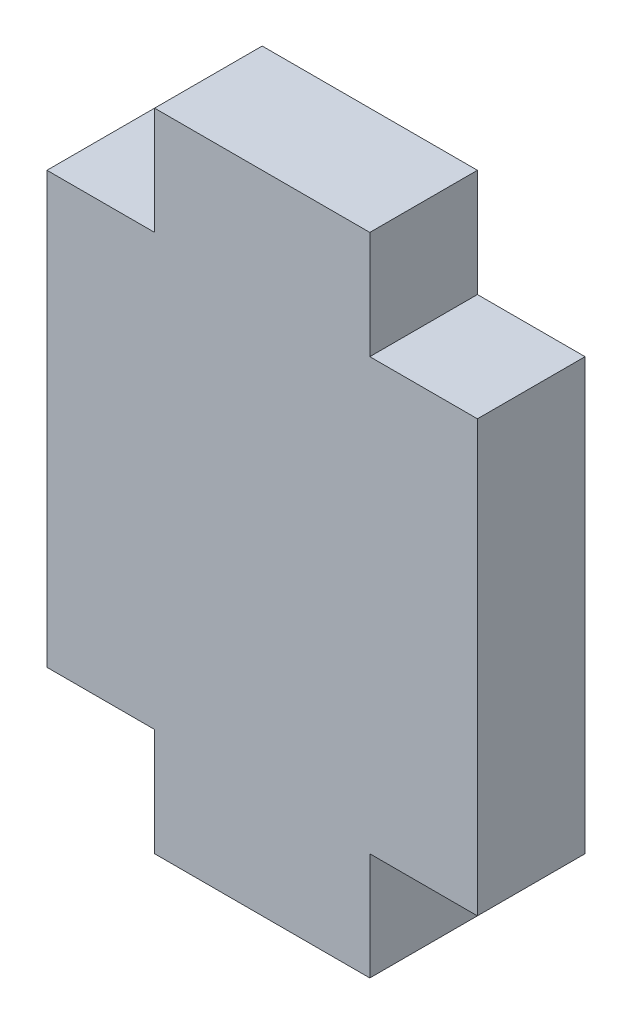
ISO-10303-21;
HEADER;
FILE_DESCRIPTION(('STEP AP214'),'2;1');
FILE_NAME('part.step','',(''),(''),'','','');
FILE_SCHEMA(('AUTOMOTIVE_DESIGN { 1 0 10303 214 1 1 1 1 }'));
ENDSEC;
DATA;
#1=APPLICATION_CONTEXT('core data for automotive mechanical design processes');
#2=APPLICATION_PROTOCOL_DEFINITION('international standard','automotive_design',2000,#1);
#3=PRODUCT_CONTEXT('',#1,'mechanical');
#4=PRODUCT('Part','Part','',(#3));
#5=PRODUCT_RELATED_PRODUCT_CATEGORY('part','',(#4));
#6=PRODUCT_DEFINITION_FORMATION('','',#4);
#7=PRODUCT_DEFINITION_CONTEXT('part definition',#1,'design');
#8=PRODUCT_DEFINITION('design','',#6,#7);
#9=PRODUCT_DEFINITION_SHAPE('','',#8);
#10=(LENGTH_UNIT() NAMED_UNIT(*) SI_UNIT(.MILLI.,.METRE.));
#11=(NAMED_UNIT(*) PLANE_ANGLE_UNIT() SI_UNIT($,.RADIAN.));
#12=(NAMED_UNIT(*) SI_UNIT($,.STERADIAN.) SOLID_ANGLE_UNIT());
#13=UNCERTAINTY_MEASURE_WITH_UNIT(LENGTH_MEASURE(1.E-05),#10,'distance_accuracy_value','');
#14=(GEOMETRIC_REPRESENTATION_CONTEXT(3) GLOBAL_UNCERTAINTY_ASSIGNED_CONTEXT((#13)) GLOBAL_UNIT_ASSIGNED_CONTEXT((#10,
#11,#12)) REPRESENTATION_CONTEXT('',''));
#15=CARTESIAN_POINT('',(0.,0.,0.));
#16=DIRECTION('',(0.,0.,1.));
#17=DIRECTION('',(1.,0.,0.));
#18=AXIS2_PLACEMENT_3D('',#15,#16,#17);
#19=CARTESIAN_POINT('',(0.,0.,6.35));
#20=DIRECTION('',(0.,-1.,0.));
#21=DIRECTION('',(1.,0.,0.));
#22=AXIS2_PLACEMENT_3D('',#19,#20,#21);
#23=PLANE('',#22);
#24=DIRECTION('',(-1.,0.,0.));
#25=VECTOR('',#24,1.);
#26=CARTESIAN_POINT('',(0.,0.,0.));
#27=LINE('',#26,#25);
#28=CARTESIAN_POINT('',(-19.05,0.,0.));
#29=VERTEX_POINT('',#28);
#30=CARTESIAN_POINT('',(-25.4,0.,0.));
#31=VERTEX_POINT('',#30);
#32=EDGE_CURVE('E152',#29,#31,#27,.T.);
#33=ORIENTED_EDGE('',*,*,#32,.F.);
#34=DIRECTION('',(0.,0.,-1.));
#35=VECTOR('',#34,1.);
#36=CARTESIAN_POINT('',(-19.05,0.,6.35));
#37=LINE('',#36,#35);
#38=CARTESIAN_POINT('',(-19.05,0.,6.35));
#39=VERTEX_POINT('',#38);
#40=EDGE_CURVE('E11',#39,#29,#37,.T.);
#41=ORIENTED_EDGE('',*,*,#40,.F.);
#42=DIRECTION('',(-1.,0.,0.));
#43=VECTOR('',#42,1.);
#44=CARTESIAN_POINT('',(0.,0.,6.35));
#45=LINE('',#44,#43);
#46=CARTESIAN_POINT('',(-25.4,0.,6.35));
#47=VERTEX_POINT('',#46);
#48=EDGE_CURVE('E181',#39,#47,#45,.T.);
#49=ORIENTED_EDGE('',*,*,#48,.T.);
#50=DIRECTION('',(0.,0.,-1.));
#51=VECTOR('',#50,1.);
#52=CARTESIAN_POINT('',(-25.4,0.,6.35));
#53=LINE('',#52,#51);
#54=EDGE_CURVE('E49',#47,#31,#53,.T.);
#55=ORIENTED_EDGE('',*,*,#54,.T.);
#56=EDGE_LOOP('',(#33,#41,#49,#55));
#57=FACE_BOUND('',#56,.T.);
#58=ADVANCED_FACE('F33',(#57),#23,.T.);
#59=CARTESIAN_POINT('',(-19.05,0.,6.35));
#60=DIRECTION('',(1.,0.,0.));
#61=DIRECTION('',(0.,0.,-1.));
#62=AXIS2_PLACEMENT_3D('',#59,#60,#61);
#63=PLANE('',#62);
#64=DIRECTION('',(0.,-1.,0.));
#65=VECTOR('',#64,1.);
#66=CARTESIAN_POINT('',(-19.05,0.,0.));
#67=LINE('',#66,#65);
#68=CARTESIAN_POINT('',(-19.05,-6.35,0.));
#69=VERTEX_POINT('',#68);
#70=EDGE_CURVE('E154',#29,#69,#67,.T.);
#71=ORIENTED_EDGE('',*,*,#70,.T.);
#72=DIRECTION('',(0.,0.,-1.));
#73=VECTOR('',#72,1.);
#74=CARTESIAN_POINT('',(-19.05,-6.35,6.35));
#75=LINE('',#74,#73);
#76=CARTESIAN_POINT('',(-19.05,-6.35,6.35));
#77=VERTEX_POINT('',#76);
#78=EDGE_CURVE('E41',#77,#69,#75,.T.);
#79=ORIENTED_EDGE('',*,*,#78,.F.);
#80=DIRECTION('',(0.,-1.,0.));
#81=VECTOR('',#80,1.);
#82=CARTESIAN_POINT('',(-19.05,0.,6.35));
#83=LINE('',#82,#81);
#84=EDGE_CURVE('E224',#39,#77,#83,.T.);
#85=ORIENTED_EDGE('',*,*,#84,.F.);
#86=ORIENTED_EDGE('',*,*,#40,.T.);
#87=EDGE_LOOP('',(#71,#79,#85,#86));
#88=FACE_BOUND('',#87,.T.);
#89=ADVANCED_FACE('F251',(#88),#63,.F.);
#90=CARTESIAN_POINT('',(0.,-6.35,6.35));
#91=DIRECTION('',(0.,1.,0.));
#92=DIRECTION('',(0.,0.,1.));
#93=AXIS2_PLACEMENT_3D('',#90,#91,#92);
#94=PLANE('',#93);
#95=DIRECTION('',(1.,0.,0.));
#96=VECTOR('',#95,1.);
#97=CARTESIAN_POINT('',(0.,-6.35,0.));
#98=LINE('',#97,#96);
#99=CARTESIAN_POINT('',(-6.35,-6.35,0.));
#100=VERTEX_POINT('',#99);
#101=EDGE_CURVE('E156',#69,#100,#98,.T.);
#102=ORIENTED_EDGE('',*,*,#101,.T.);
#103=DIRECTION('',(0.,0.,-1.));
#104=VECTOR('',#103,1.);
#105=CARTESIAN_POINT('',(-6.35,-6.35,6.35));
#106=LINE('',#105,#104);
#107=CARTESIAN_POINT('',(-6.35,-6.35,6.35));
#108=VERTEX_POINT('',#107);
#109=EDGE_CURVE('E197',#108,#100,#106,.T.);
#110=ORIENTED_EDGE('',*,*,#109,.F.);
#111=DIRECTION('',(1.,0.,0.));
#112=VECTOR('',#111,1.);
#113=CARTESIAN_POINT('',(0.,-6.35,6.35));
#114=LINE('',#113,#112);
#115=EDGE_CURVE('E205',#77,#108,#114,.T.);
#116=ORIENTED_EDGE('',*,*,#115,.F.);
#117=ORIENTED_EDGE('',*,*,#78,.T.);
#118=EDGE_LOOP('',(#102,#110,#116,#117));
#119=FACE_BOUND('',#118,.T.);
#120=ADVANCED_FACE('F203',(#119),#94,.F.);
#121=CARTESIAN_POINT('',(-6.35,0.,6.35));
#122=DIRECTION('',(1.,0.,0.));
#123=DIRECTION('',(0.,0.,-1.));
#124=AXIS2_PLACEMENT_3D('',#121,#122,#123);
#125=PLANE('',#124);
#126=DIRECTION('',(0.,-1.,0.));
#127=VECTOR('',#126,1.);
#128=CARTESIAN_POINT('',(-6.35,0.,0.));
#129=LINE('',#128,#127);
#130=CARTESIAN_POINT('',(-6.35,0.,0.));
#131=VERTEX_POINT('',#130);
#132=EDGE_CURVE('E159',#131,#100,#129,.T.);
#133=ORIENTED_EDGE('',*,*,#132,.F.);
#134=DIRECTION('',(0.,0.,-1.));
#135=VECTOR('',#134,1.);
#136=CARTESIAN_POINT('',(-6.35,0.,6.35));
#137=LINE('',#136,#135);
#138=CARTESIAN_POINT('',(-6.35,0.,6.35));
#139=VERTEX_POINT('',#138);
#140=EDGE_CURVE('E195',#139,#131,#137,.T.);
#141=ORIENTED_EDGE('',*,*,#140,.F.);
#142=DIRECTION('',(0.,-1.,0.));
#143=VECTOR('',#142,1.);
#144=CARTESIAN_POINT('',(-6.35,0.,6.35));
#145=LINE('',#144,#143);
#146=EDGE_CURVE('E217',#139,#108,#145,.T.);
#147=ORIENTED_EDGE('',*,*,#146,.T.);
#148=ORIENTED_EDGE('',*,*,#109,.T.);
#149=EDGE_LOOP('',(#133,#141,#147,#148));
#150=FACE_BOUND('',#149,.T.);
#151=ADVANCED_FACE('F214',(#150),#125,.T.);
#152=CARTESIAN_POINT('',(0.,0.,6.35));
#153=DIRECTION('',(0.,-1.,0.));
#154=DIRECTION('',(1.,0.,0.));
#155=AXIS2_PLACEMENT_3D('',#152,#153,#154);
#156=PLANE('',#155);
#157=DIRECTION('',(-1.,0.,0.));
#158=VECTOR('',#157,1.);
#159=CARTESIAN_POINT('',(0.,0.,0.));
#160=LINE('',#159,#158);
#161=CARTESIAN_POINT('',(0.,0.,0.));
#162=VERTEX_POINT('',#161);
#163=EDGE_CURVE('E162',#162,#131,#160,.T.);
#164=ORIENTED_EDGE('',*,*,#163,.F.);
#165=DIRECTION('',(0.,0.,-1.));
#166=VECTOR('',#165,1.);
#167=CARTESIAN_POINT('',(0.,0.,6.35));
#168=LINE('',#167,#166);
#169=CARTESIAN_POINT('',(0.,0.,6.35));
#170=VERTEX_POINT('',#169);
#171=EDGE_CURVE('E193',#170,#162,#168,.T.);
#172=ORIENTED_EDGE('',*,*,#171,.F.);
#173=DIRECTION('',(-1.,0.,0.));
#174=VECTOR('',#173,1.);
#175=CARTESIAN_POINT('',(0.,0.,6.35));
#176=LINE('',#175,#174);
#177=EDGE_CURVE('E220',#170,#139,#176,.T.);
#178=ORIENTED_EDGE('',*,*,#177,.T.);
#179=ORIENTED_EDGE('',*,*,#140,.T.);
#180=EDGE_LOOP('',(#164,#172,#178,#179));
#181=FACE_BOUND('',#180,.T.);
#182=ADVANCED_FACE('F262',(#181),#156,.T.);
#183=CARTESIAN_POINT('',(0.,0.,6.35));
#184=DIRECTION('',(-1.,0.,0.));
#185=DIRECTION('',(0.,0.,1.));
#186=AXIS2_PLACEMENT_3D('',#183,#184,#185);
#187=PLANE('',#186);
#188=DIRECTION('',(0.,1.,0.));
#189=VECTOR('',#188,1.);
#190=CARTESIAN_POINT('',(0.,0.,0.));
#191=LINE('',#190,#189);
#192=CARTESIAN_POINT('',(0.,25.4,0.));
#193=VERTEX_POINT('',#192);
#194=EDGE_CURVE('E165',#162,#193,#191,.T.);
#195=ORIENTED_EDGE('',*,*,#194,.T.);
#196=DIRECTION('',(0.,0.,-1.));
#197=VECTOR('',#196,1.);
#198=CARTESIAN_POINT('',(0.,25.4,6.35));
#199=LINE('',#198,#197);
#200=CARTESIAN_POINT('',(0.,25.4,6.35));
#201=VERTEX_POINT('',#200);
#202=EDGE_CURVE('E190',#201,#193,#199,.T.);
#203=ORIENTED_EDGE('',*,*,#202,.F.);
#204=DIRECTION('',(0.,1.,0.));
#205=VECTOR('',#204,1.);
#206=CARTESIAN_POINT('',(0.,0.,6.35));
#207=LINE('',#206,#205);
#208=EDGE_CURVE('E222',#170,#201,#207,.T.);
#209=ORIENTED_EDGE('',*,*,#208,.F.);
#210=ORIENTED_EDGE('',*,*,#171,.T.);
#211=EDGE_LOOP('',(#195,#203,#209,#210));
#212=FACE_BOUND('',#211,.T.);
#213=ADVANCED_FACE('F265',(#212),#187,.F.);
#214=CARTESIAN_POINT('',(0.,25.4,6.35));
#215=DIRECTION('',(0.,-1.,0.));
#216=DIRECTION('',(1.,0.,0.));
#217=AXIS2_PLACEMENT_3D('',#214,#215,#216);
#218=PLANE('',#217);
#219=DIRECTION('',(-1.,0.,0.));
#220=VECTOR('',#219,1.);
#221=CARTESIAN_POINT('',(0.,25.4,0.));
#222=LINE('',#221,#220);
#223=CARTESIAN_POINT('',(-6.35,25.4,0.));
#224=VERTEX_POINT('',#223);
#225=EDGE_CURVE('E167',#193,#224,#222,.T.);
#226=ORIENTED_EDGE('',*,*,#225,.T.);
#227=DIRECTION('',(0.,0.,-1.));
#228=VECTOR('',#227,1.);
#229=CARTESIAN_POINT('',(-6.35,25.4,6.35));
#230=LINE('',#229,#228);
#231=CARTESIAN_POINT('',(-6.35,25.4,6.35));
#232=VERTEX_POINT('',#231);
#233=EDGE_CURVE('E187',#232,#224,#230,.T.);
#234=ORIENTED_EDGE('',*,*,#233,.F.);
#235=DIRECTION('',(-1.,0.,0.));
#236=VECTOR('',#235,1.);
#237=CARTESIAN_POINT('',(0.,25.4,6.35));
#238=LINE('',#237,#236);
#239=EDGE_CURVE('E229',#201,#232,#238,.T.);
#240=ORIENTED_EDGE('',*,*,#239,.F.);
#241=ORIENTED_EDGE('',*,*,#202,.T.);
#242=EDGE_LOOP('',(#226,#234,#240,#241));
#243=FACE_BOUND('',#242,.T.);
#244=ADVANCED_FACE('F269',(#243),#218,.F.);
#245=CARTESIAN_POINT('',(-6.35,0.,6.35));
#246=DIRECTION('',(-1.,0.,0.));
#247=DIRECTION('',(0.,0.,1.));
#248=AXIS2_PLACEMENT_3D('',#245,#246,#247);
#249=PLANE('',#248);
#250=DIRECTION('',(0.,1.,0.));
#251=VECTOR('',#250,1.);
#252=CARTESIAN_POINT('',(-6.35,0.,0.));
#253=LINE('',#252,#251);
#254=CARTESIAN_POINT('',(-6.35,31.75,0.));
#255=VERTEX_POINT('',#254);
#256=EDGE_CURVE('E169',#224,#255,#253,.T.);
#257=ORIENTED_EDGE('',*,*,#256,.T.);
#258=DIRECTION('',(0.,0.,-1.));
#259=VECTOR('',#258,1.);
#260=CARTESIAN_POINT('',(-6.35,31.75,6.35));
#261=LINE('',#260,#259);
#262=CARTESIAN_POINT('',(-6.35,31.75,6.35));
#263=VERTEX_POINT('',#262);
#264=EDGE_CURVE('E185',#263,#255,#261,.T.);
#265=ORIENTED_EDGE('',*,*,#264,.F.);
#266=DIRECTION('',(0.,1.,0.));
#267=VECTOR('',#266,1.);
#268=CARTESIAN_POINT('',(-6.35,0.,6.35));
#269=LINE('',#268,#267);
#270=EDGE_CURVE('E147',#232,#263,#269,.T.);
#271=ORIENTED_EDGE('',*,*,#270,.F.);
#272=ORIENTED_EDGE('',*,*,#233,.T.);
#273=EDGE_LOOP('',(#257,#265,#271,#272));
#274=FACE_BOUND('',#273,.T.);
#275=ADVANCED_FACE('F235',(#274),#249,.F.);
#276=CARTESIAN_POINT('',(0.,31.75,6.35));
#277=DIRECTION('',(0.,1.,0.));
#278=DIRECTION('',(0.,0.,1.));
#279=AXIS2_PLACEMENT_3D('',#276,#277,#278);
#280=PLANE('',#279);
#281=DIRECTION('',(1.,0.,0.));
#282=VECTOR('',#281,1.);
#283=CARTESIAN_POINT('',(0.,31.75,0.));
#284=LINE('',#283,#282);
#285=CARTESIAN_POINT('',(-19.05,31.75,0.));
#286=VERTEX_POINT('',#285);
#287=EDGE_CURVE('E172',#286,#255,#284,.T.);
#288=ORIENTED_EDGE('',*,*,#287,.F.);
#289=DIRECTION('',(0.,0.,-1.));
#290=VECTOR('',#289,1.);
#291=CARTESIAN_POINT('',(-19.05,31.75,6.35));
#292=LINE('',#291,#290);
#293=CARTESIAN_POINT('',(-19.05,31.75,6.35));
#294=VERTEX_POINT('',#293);
#295=EDGE_CURVE('E133',#294,#286,#292,.T.);
#296=ORIENTED_EDGE('',*,*,#295,.F.);
#297=DIRECTION('',(1.,0.,0.));
#298=VECTOR('',#297,1.);
#299=CARTESIAN_POINT('',(0.,31.75,6.35));
#300=LINE('',#299,#298);
#301=EDGE_CURVE('E145',#294,#263,#300,.T.);
#302=ORIENTED_EDGE('',*,*,#301,.T.);
#303=ORIENTED_EDGE('',*,*,#264,.T.);
#304=EDGE_LOOP('',(#288,#296,#302,#303));
#305=FACE_BOUND('',#304,.T.);
#306=ADVANCED_FACE('F239',(#305),#280,.T.);
#307=CARTESIAN_POINT('',(-19.05,0.,6.35));
#308=DIRECTION('',(-1.,0.,0.));
#309=DIRECTION('',(0.,0.,1.));
#310=AXIS2_PLACEMENT_3D('',#307,#308,#309);
#311=PLANE('',#310);
#312=DIRECTION('',(0.,1.,0.));
#313=VECTOR('',#312,1.);
#314=CARTESIAN_POINT('',(-19.05,0.,0.));
#315=LINE('',#314,#313);
#316=CARTESIAN_POINT('',(-19.05,25.4,0.));
#317=VERTEX_POINT('',#316);
#318=EDGE_CURVE('E130',#317,#286,#315,.T.);
#319=ORIENTED_EDGE('',*,*,#318,.F.);
#320=DIRECTION('',(0.,0.,-1.));
#321=VECTOR('',#320,1.);
#322=CARTESIAN_POINT('',(-19.05,25.4,6.35));
#323=LINE('',#322,#321);
#324=CARTESIAN_POINT('',(-19.05,25.4,6.35));
#325=VERTEX_POINT('',#324);
#326=EDGE_CURVE('E124',#325,#317,#323,.T.);
#327=ORIENTED_EDGE('',*,*,#326,.F.);
#328=DIRECTION('',(0.,1.,0.));
#329=VECTOR('',#328,1.);
#330=CARTESIAN_POINT('',(-19.05,0.,6.35));
#331=LINE('',#330,#329);
#332=EDGE_CURVE('E128',#325,#294,#331,.T.);
#333=ORIENTED_EDGE('',*,*,#332,.T.);
#334=ORIENTED_EDGE('',*,*,#295,.T.);
#335=EDGE_LOOP('',(#319,#327,#333,#334));
#336=FACE_BOUND('',#335,.T.);
#337=ADVANCED_FACE('F126',(#336),#311,.T.);
#338=CARTESIAN_POINT('',(0.,25.4,6.35));
#339=DIRECTION('',(0.,-1.,0.));
#340=DIRECTION('',(1.,0.,0.));
#341=AXIS2_PLACEMENT_3D('',#338,#339,#340);
#342=PLANE('',#341);
#343=DIRECTION('',(-1.,0.,0.));
#344=VECTOR('',#343,1.);
#345=CARTESIAN_POINT('',(0.,25.4,0.));
#346=LINE('',#345,#344);
#347=CARTESIAN_POINT('',(-25.4,25.4,0.));
#348=VERTEX_POINT('',#347);
#349=EDGE_CURVE('E176',#317,#348,#346,.T.);
#350=ORIENTED_EDGE('',*,*,#349,.T.);
#351=DIRECTION('',(0.,0.,-1.));
#352=VECTOR('',#351,1.);
#353=CARTESIAN_POINT('',(-25.4,25.4,6.35));
#354=LINE('',#353,#352);
#355=CARTESIAN_POINT('',(-25.4,25.4,6.35));
#356=VERTEX_POINT('',#355);
#357=EDGE_CURVE('E87',#356,#348,#354,.T.);
#358=ORIENTED_EDGE('',*,*,#357,.F.);
#359=DIRECTION('',(-1.,0.,0.));
#360=VECTOR('',#359,1.);
#361=CARTESIAN_POINT('',(0.,25.4,6.35));
#362=LINE('',#361,#360);
#363=EDGE_CURVE('E135',#325,#356,#362,.T.);
#364=ORIENTED_EDGE('',*,*,#363,.F.);
#365=ORIENTED_EDGE('',*,*,#326,.T.);
#366=EDGE_LOOP('',(#350,#358,#364,#365));
#367=FACE_BOUND('',#366,.T.);
#368=ADVANCED_FACE('F136',(#367),#342,.F.);
#369=CARTESIAN_POINT('',(-25.4,0.,6.35));
#370=DIRECTION('',(-1.,0.,0.));
#371=DIRECTION('',(0.,0.,1.));
#372=AXIS2_PLACEMENT_3D('',#369,#370,#371);
#373=PLANE('',#372);
#374=DIRECTION('',(0.,1.,0.));
#375=VECTOR('',#374,1.);
#376=CARTESIAN_POINT('',(-25.4,0.,0.));
#377=LINE('',#376,#375);
#378=EDGE_CURVE('E178',#31,#348,#377,.T.);
#379=ORIENTED_EDGE('',*,*,#378,.F.);
#380=ORIENTED_EDGE('',*,*,#54,.F.);
#381=DIRECTION('',(0.,1.,0.));
#382=VECTOR('',#381,1.);
#383=CARTESIAN_POINT('',(-25.4,0.,6.35));
#384=LINE('',#383,#382);
#385=EDGE_CURVE('E139',#47,#356,#384,.T.);
#386=ORIENTED_EDGE('',*,*,#385,.T.);
#387=ORIENTED_EDGE('',*,*,#357,.T.);
#388=EDGE_LOOP('',(#379,#380,#386,#387));
#389=FACE_BOUND('',#388,.T.);
#390=ADVANCED_FACE('F240',(#389),#373,.T.);
#391=CARTESIAN_POINT('',(0.,0.,6.35));
#392=DIRECTION('',(0.,0.,1.));
#393=DIRECTION('',(1.,0.,0.));
#394=AXIS2_PLACEMENT_3D('',#391,#392,#393);
#395=PLANE('',#394);
#396=ORIENTED_EDGE('',*,*,#48,.F.);
#397=ORIENTED_EDGE('',*,*,#84,.T.);
#398=ORIENTED_EDGE('',*,*,#115,.T.);
#399=ORIENTED_EDGE('',*,*,#146,.F.);
#400=ORIENTED_EDGE('',*,*,#177,.F.);
#401=ORIENTED_EDGE('',*,*,#208,.T.);
#402=ORIENTED_EDGE('',*,*,#239,.T.);
#403=ORIENTED_EDGE('',*,*,#270,.T.);
#404=ORIENTED_EDGE('',*,*,#301,.F.);
#405=ORIENTED_EDGE('',*,*,#332,.F.);
#406=ORIENTED_EDGE('',*,*,#363,.T.);
#407=ORIENTED_EDGE('',*,*,#385,.F.);
#408=EDGE_LOOP('',(#396,#397,#398,#399,#400,#401,#402,#403,#404,#405,#406,#407));
#409=FACE_BOUND('',#408,.T.);
#410=ADVANCED_FACE('F143',(#409),#395,.T.);
#411=CARTESIAN_POINT('',(0.,0.,0.));
#412=DIRECTION('',(0.,0.,1.));
#413=DIRECTION('',(1.,0.,0.));
#414=AXIS2_PLACEMENT_3D('',#411,#412,#413);
#415=PLANE('',#414);
#416=ORIENTED_EDGE('',*,*,#32,.T.);
#417=ORIENTED_EDGE('',*,*,#378,.T.);
#418=ORIENTED_EDGE('',*,*,#349,.F.);
#419=ORIENTED_EDGE('',*,*,#318,.T.);
#420=ORIENTED_EDGE('',*,*,#287,.T.);
#421=ORIENTED_EDGE('',*,*,#256,.F.);
#422=ORIENTED_EDGE('',*,*,#225,.F.);
#423=ORIENTED_EDGE('',*,*,#194,.F.);
#424=ORIENTED_EDGE('',*,*,#163,.T.);
#425=ORIENTED_EDGE('',*,*,#132,.T.);
#426=ORIENTED_EDGE('',*,*,#101,.F.);
#427=ORIENTED_EDGE('',*,*,#70,.F.);
#428=EDGE_LOOP('',(#416,#417,#418,#419,#420,#421,#422,#423,#424,#425,#426,#427));
#429=FACE_BOUND('',#428,.T.);
#430=ADVANCED_FACE('F209',(#429),#415,.F.);
#431=CLOSED_SHELL('',(#58,#89,#120,#151,#182,#213,#244,#275,#306,#337,#368,#390,#410,#430));
#432=MANIFOLD_SOLID_BREP('B2',#431);
#433=ADVANCED_BREP_SHAPE_REPRESENTATION('',(#18,#432),#14);
#434=SHAPE_DEFINITION_REPRESENTATION(#9,#433);
ENDSEC;
END-ISO-10303-21;
